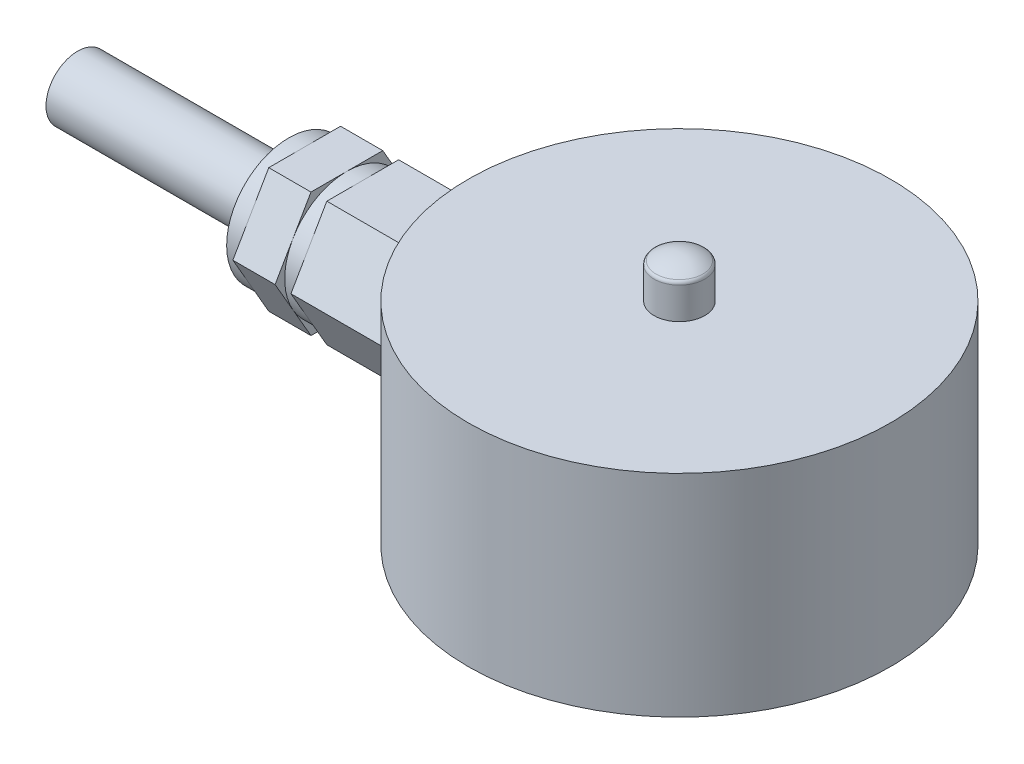
ISO-10303-21;
HEADER;
FILE_DESCRIPTION(('STEP AP214'),'2;1');
FILE_NAME('part.step','',(''),(''),'','','');
FILE_SCHEMA(('AUTOMOTIVE_DESIGN { 1 0 10303 214 1 1 1 1 }'));
ENDSEC;
DATA;
#1=APPLICATION_CONTEXT('core data for automotive mechanical design processes');
#2=APPLICATION_PROTOCOL_DEFINITION('international standard','automotive_design',2000,#1);
#3=PRODUCT_CONTEXT('',#1,'mechanical');
#4=PRODUCT('Part','Part','',(#3));
#5=PRODUCT_RELATED_PRODUCT_CATEGORY('part','',(#4));
#6=PRODUCT_DEFINITION_FORMATION('','',#4);
#7=PRODUCT_DEFINITION_CONTEXT('part definition',#1,'design');
#8=PRODUCT_DEFINITION('design','',#6,#7);
#9=PRODUCT_DEFINITION_SHAPE('','',#8);
#10=(LENGTH_UNIT() NAMED_UNIT(*) SI_UNIT(.MILLI.,.METRE.));
#11=(NAMED_UNIT(*) PLANE_ANGLE_UNIT() SI_UNIT($,.RADIAN.));
#12=(NAMED_UNIT(*) SI_UNIT($,.STERADIAN.) SOLID_ANGLE_UNIT());
#13=UNCERTAINTY_MEASURE_WITH_UNIT(LENGTH_MEASURE(1.E-05),#10,'distance_accuracy_value','');
#14=(GEOMETRIC_REPRESENTATION_CONTEXT(3) GLOBAL_UNCERTAINTY_ASSIGNED_CONTEXT((#13)) GLOBAL_UNIT_ASSIGNED_CONTEXT((#10,
#11,#12)) REPRESENTATION_CONTEXT('',''));
#15=CARTESIAN_POINT('',(0.,0.,0.));
#16=DIRECTION('',(0.,0.,1.));
#17=DIRECTION('',(1.,0.,0.));
#18=AXIS2_PLACEMENT_3D('',#15,#16,#17);
#19=CARTESIAN_POINT('',(-17.75,0.,0.));
#20=DIRECTION('',(-1.,0.,0.));
#21=DIRECTION('',(0.,0.,1.));
#22=AXIS2_PLACEMENT_3D('',#19,#20,#21);
#23=PLANE('',#22);
#24=CARTESIAN_POINT('',(-17.75,4.5,0.));
#25=DIRECTION('',(-1.,0.,0.));
#26=DIRECTION('',(0.,0.,1.));
#27=AXIS2_PLACEMENT_3D('',#24,#25,#26);
#28=CIRCLE('',#27,2.94448637286709);
#29=CARTESIAN_POINT('',(-17.75,5.97224318643355,2.55));
#30=VERTEX_POINT('',#29);
#31=CARTESIAN_POINT('',(-17.75,7.4444863728671,0.));
#32=VERTEX_POINT('',#31);
#33=EDGE_CURVE('E189',#30,#32,#28,.T.);
#34=ORIENTED_EDGE('',*,*,#33,.F.);
#35=DIRECTION('',(0.,0.866025403784439,-0.5));
#36=VECTOR('',#35,1.);
#37=CARTESIAN_POINT('',(-17.75,4.5,3.4));
#38=LINE('',#37,#36);
#39=CARTESIAN_POINT('',(-17.75,7.4444863728671,1.7));
#40=VERTEX_POINT('',#39);
#41=EDGE_CURVE('E176',#30,#40,#38,.T.);
#42=ORIENTED_EDGE('',*,*,#41,.T.);
#43=DIRECTION('',(0.,0.,-1.));
#44=VECTOR('',#43,1.);
#45=CARTESIAN_POINT('',(-17.75,7.4444863728671,1.7));
#46=LINE('',#45,#44);
#47=EDGE_CURVE('E190',#40,#32,#46,.T.);
#48=ORIENTED_EDGE('',*,*,#47,.T.);
#49=EDGE_LOOP('',(#34,#42,#48));
#50=FACE_BOUND('',#49,.T.);
#51=ADVANCED_FACE('F17',(#50),#23,.T.);
#52=CARTESIAN_POINT('',(-17.75,5.97224318643356,-2.55));
#53=VERTEX_POINT('',#52);
#54=EDGE_CURVE('E196',#32,#53,#28,.T.);
#55=ORIENTED_EDGE('',*,*,#54,.F.);
#56=CARTESIAN_POINT('',(-17.75,7.4444863728671,-1.7));
#57=VERTEX_POINT('',#56);
#58=EDGE_CURVE('E175',#32,#57,#46,.T.);
#59=ORIENTED_EDGE('',*,*,#58,.T.);
#60=DIRECTION('',(0.,-0.866025403784438,-0.5));
#61=VECTOR('',#60,1.);
#62=CARTESIAN_POINT('',(-17.75,7.4444863728671,-1.7));
#63=LINE('',#62,#61);
#64=EDGE_CURVE('E210',#57,#53,#63,.T.);
#65=ORIENTED_EDGE('',*,*,#64,.T.);
#66=EDGE_LOOP('',(#55,#59,#65));
#67=FACE_BOUND('',#66,.T.);
#68=ADVANCED_FACE('F384',(#67),#23,.T.);
#69=CARTESIAN_POINT('',(-17.75,3.02775681356646,-2.55));
#70=VERTEX_POINT('',#69);
#71=EDGE_CURVE('E359',#53,#70,#28,.T.);
#72=ORIENTED_EDGE('',*,*,#71,.F.);
#73=CARTESIAN_POINT('',(-17.75,4.5,-3.4));
#74=VERTEX_POINT('',#73);
#75=EDGE_CURVE('E209',#53,#74,#63,.T.);
#76=ORIENTED_EDGE('',*,*,#75,.T.);
#77=DIRECTION('',(0.,-0.866025403784439,0.5));
#78=VECTOR('',#77,1.);
#79=CARTESIAN_POINT('',(-17.75,4.5,-3.4));
#80=LINE('',#79,#78);
#81=EDGE_CURVE('E214',#74,#70,#80,.T.);
#82=ORIENTED_EDGE('',*,*,#81,.T.);
#83=EDGE_LOOP('',(#72,#76,#82));
#84=FACE_BOUND('',#83,.T.);
#85=ADVANCED_FACE('F390',(#84),#23,.T.);
#86=CARTESIAN_POINT('',(-17.75,1.5555136271329,0.));
#87=VERTEX_POINT('',#86);
#88=EDGE_CURVE('E200',#70,#87,#28,.T.);
#89=ORIENTED_EDGE('',*,*,#88,.F.);
#90=CARTESIAN_POINT('',(-17.75,1.5555136271329,-1.7));
#91=VERTEX_POINT('',#90);
#92=EDGE_CURVE('E213',#70,#91,#80,.T.);
#93=ORIENTED_EDGE('',*,*,#92,.T.);
#94=DIRECTION('',(0.,0.,1.));
#95=VECTOR('',#94,1.);
#96=CARTESIAN_POINT('',(-17.75,1.5555136271329,-1.7));
#97=LINE('',#96,#95);
#98=EDGE_CURVE('E218',#91,#87,#97,.T.);
#99=ORIENTED_EDGE('',*,*,#98,.T.);
#100=EDGE_LOOP('',(#89,#93,#99));
#101=FACE_BOUND('',#100,.T.);
#102=ADVANCED_FACE('F409',(#101),#23,.T.);
#103=CARTESIAN_POINT('',(-17.75,3.02775681356646,2.55));
#104=VERTEX_POINT('',#103);
#105=EDGE_CURVE('E40',#87,#104,#28,.T.);
#106=ORIENTED_EDGE('',*,*,#105,.F.);
#107=CARTESIAN_POINT('',(-17.75,1.5555136271329,1.7));
#108=VERTEX_POINT('',#107);
#109=EDGE_CURVE('E217',#87,#108,#97,.T.);
#110=ORIENTED_EDGE('',*,*,#109,.T.);
#111=DIRECTION('',(0.,0.866025403784439,0.5));
#112=VECTOR('',#111,1.);
#113=CARTESIAN_POINT('',(-17.75,1.5555136271329,1.7));
#114=LINE('',#113,#112);
#115=EDGE_CURVE('E221',#108,#104,#114,.T.);
#116=ORIENTED_EDGE('',*,*,#115,.T.);
#117=EDGE_LOOP('',(#106,#110,#116));
#118=FACE_BOUND('',#117,.T.);
#119=ADVANCED_FACE('F396',(#118),#23,.T.);
#120=CARTESIAN_POINT('',(-15.,0.,0.));
#121=DIRECTION('',(1.,0.,0.));
#122=DIRECTION('',(0.,0.,-1.));
#123=AXIS2_PLACEMENT_3D('',#120,#121,#122);
#124=PLANE('',#123);
#125=CARTESIAN_POINT('',(-15.,4.5,0.));
#126=DIRECTION('',(-1.,0.,0.));
#127=DIRECTION('',(0.,0.,1.));
#128=AXIS2_PLACEMENT_3D('',#125,#126,#127);
#129=CIRCLE('',#128,2.94448637286709);
#130=CARTESIAN_POINT('',(-15.,5.97224318643355,2.55));
#131=VERTEX_POINT('',#130);
#132=CARTESIAN_POINT('',(-15.,7.4444863728671,0.));
#133=VERTEX_POINT('',#132);
#134=EDGE_CURVE('E204',#131,#133,#129,.T.);
#135=ORIENTED_EDGE('',*,*,#134,.F.);
#136=DIRECTION('',(0.,-0.866025403784439,0.5));
#137=VECTOR('',#136,1.);
#138=CARTESIAN_POINT('',(-15.,7.4444863728671,1.7));
#139=LINE('',#138,#137);
#140=CARTESIAN_POINT('',(-15.,7.4444863728671,1.7));
#141=VERTEX_POINT('',#140);
#142=EDGE_CURVE('E296',#141,#131,#139,.T.);
#143=ORIENTED_EDGE('',*,*,#142,.F.);
#144=DIRECTION('',(0.,0.,1.));
#145=VECTOR('',#144,1.);
#146=CARTESIAN_POINT('',(-15.,7.4444863728671,-1.7));
#147=LINE('',#146,#145);
#148=EDGE_CURVE('E291',#133,#141,#147,.T.);
#149=ORIENTED_EDGE('',*,*,#148,.F.);
#150=EDGE_LOOP('',(#135,#143,#149));
#151=FACE_BOUND('',#150,.T.);
#152=ADVANCED_FACE('F408',(#151),#124,.F.);
#153=CARTESIAN_POINT('',(-15.,5.97224318643355,-2.55));
#154=VERTEX_POINT('',#153);
#155=EDGE_CURVE('E199',#133,#154,#129,.T.);
#156=ORIENTED_EDGE('',*,*,#155,.F.);
#157=CARTESIAN_POINT('',(-15.,7.4444863728671,-1.7));
#158=VERTEX_POINT('',#157);
#159=EDGE_CURVE('E292',#158,#133,#147,.T.);
#160=ORIENTED_EDGE('',*,*,#159,.F.);
#161=DIRECTION('',(0.,0.866025403784439,0.5));
#162=VECTOR('',#161,1.);
#163=CARTESIAN_POINT('',(-15.,4.5,-3.4));
#164=LINE('',#163,#162);
#165=EDGE_CURVE('E287',#154,#158,#164,.T.);
#166=ORIENTED_EDGE('',*,*,#165,.F.);
#167=EDGE_LOOP('',(#156,#160,#166));
#168=FACE_BOUND('',#167,.T.);
#169=ADVANCED_FACE('F415',(#168),#124,.F.);
#170=CARTESIAN_POINT('',(-15.,3.02775681356646,-2.55));
#171=VERTEX_POINT('',#170);
#172=EDGE_CURVE('E202',#154,#171,#129,.T.);
#173=ORIENTED_EDGE('',*,*,#172,.F.);
#174=CARTESIAN_POINT('',(-15.,4.5,-3.4));
#175=VERTEX_POINT('',#174);
#176=EDGE_CURVE('E288',#175,#154,#164,.T.);
#177=ORIENTED_EDGE('',*,*,#176,.F.);
#178=DIRECTION('',(0.,0.866025403784439,-0.5));
#179=VECTOR('',#178,1.);
#180=CARTESIAN_POINT('',(-15.,1.5555136271329,-1.7));
#181=LINE('',#180,#179);
#182=EDGE_CURVE('E283',#171,#175,#181,.T.);
#183=ORIENTED_EDGE('',*,*,#182,.F.);
#184=EDGE_LOOP('',(#173,#177,#183));
#185=FACE_BOUND('',#184,.T.);
#186=ADVANCED_FACE('F762',(#185),#124,.F.);
#187=CARTESIAN_POINT('',(-15.,1.5555136271329,0.));
#188=VERTEX_POINT('',#187);
#189=EDGE_CURVE('E922',#171,#188,#129,.T.);
#190=ORIENTED_EDGE('',*,*,#189,.F.);
#191=CARTESIAN_POINT('',(-15.,1.5555136271329,-1.7));
#192=VERTEX_POINT('',#191);
#193=EDGE_CURVE('E284',#192,#171,#181,.T.);
#194=ORIENTED_EDGE('',*,*,#193,.F.);
#195=DIRECTION('',(0.,0.,-1.));
#196=VECTOR('',#195,1.);
#197=CARTESIAN_POINT('',(-15.,1.5555136271329,1.7));
#198=LINE('',#197,#196);
#199=EDGE_CURVE('E262',#188,#192,#198,.T.);
#200=ORIENTED_EDGE('',*,*,#199,.F.);
#201=EDGE_LOOP('',(#190,#194,#200));
#202=FACE_BOUND('',#201,.T.);
#203=ADVANCED_FACE('F755',(#202),#124,.F.);
#204=CARTESIAN_POINT('',(-15.,3.02775681356646,2.55));
#205=VERTEX_POINT('',#204);
#206=EDGE_CURVE('E917',#188,#205,#129,.T.);
#207=ORIENTED_EDGE('',*,*,#206,.F.);
#208=CARTESIAN_POINT('',(-15.,1.5555136271329,1.7));
#209=VERTEX_POINT('',#208);
#210=EDGE_CURVE('E280',#209,#188,#198,.T.);
#211=ORIENTED_EDGE('',*,*,#210,.F.);
#212=DIRECTION('',(0.,-0.866025403784439,-0.5));
#213=VECTOR('',#212,1.);
#214=CARTESIAN_POINT('',(-15.,4.5,3.4));
#215=LINE('',#214,#213);
#216=EDGE_CURVE('E298',#205,#209,#215,.T.);
#217=ORIENTED_EDGE('',*,*,#216,.F.);
#218=EDGE_LOOP('',(#207,#211,#217));
#219=FACE_BOUND('',#218,.T.);
#220=ADVANCED_FACE('F653',(#219),#124,.F.);
#221=CARTESIAN_POINT('',(0.,10.,0.));
#222=DIRECTION('',(0.,-1.,0.));
#223=DIRECTION('',(0.,0.,-1.));
#224=AXIS2_PLACEMENT_3D('',#221,#222,#223);
#225=CYLINDRICAL_SURFACE('',#224,10.);
#226=CARTESIAN_POINT('',(0.,0.,0.));
#227=DIRECTION('',(0.,1.,0.));
#228=DIRECTION('',(0.,0.,1.));
#229=AXIS2_PLACEMENT_3D('',#226,#227,#228);
#230=CIRCLE('',#229,10.);
#231=CARTESIAN_POINT('',(0.,0.,10.));
#232=VERTEX_POINT('',#231);
#233=EDGE_CURVE('E341',#232,#232,#230,.T.);
#234=ORIENTED_EDGE('',*,*,#233,.T.);
#235=EDGE_LOOP('',(#234));
#236=FACE_BOUND('',#235,.T.);
#237=CARTESIAN_POINT('',(0.,10.,0.));
#238=DIRECTION('',(0.,1.,0.));
#239=DIRECTION('',(0.,0.,1.));
#240=AXIS2_PLACEMENT_3D('',#237,#238,#239);
#241=CIRCLE('',#240,10.);
#242=CARTESIAN_POINT('',(0.,10.,10.));
#243=VERTEX_POINT('',#242);
#244=EDGE_CURVE('E342',#243,#243,#241,.T.);
#245=ORIENTED_EDGE('',*,*,#244,.F.);
#246=EDGE_LOOP('',(#245));
#247=FACE_BOUND('',#246,.T.);
#248=CARTESIAN_POINT('',(0.,-1.38897274573418,0.));
#249=DIRECTION('',(0.,0.5,-0.866025403784439));
#250=DIRECTION('',(0.,-0.866025403784439,-0.5));
#251=AXIS2_PLACEMENT_3D('',#248,#249,#250);
#252=ELLIPSE('',#251,20.,10.);
#253=CARTESIAN_POINT('',(-9.40425435640699,4.5,3.4));
#254=VERTEX_POINT('',#253);
#255=CARTESIAN_POINT('',(-9.8544406233941,1.5555136271329,1.7));
#256=VERTEX_POINT('',#255);
#257=EDGE_CURVE('E279',#254,#256,#252,.F.);
#258=ORIENTED_EDGE('',*,*,#257,.T.);
#259=CARTESIAN_POINT('',(0.,1.5555136271329,0.));
#260=DIRECTION('',(0.,1.,0.));
#261=DIRECTION('',(0.,0.,1.));
#262=AXIS2_PLACEMENT_3D('',#259,#260,#261);
#263=CIRCLE('',#262,10.);
#264=CARTESIAN_POINT('',(-9.8544406233941,1.5555136271329,-1.7));
#265=VERTEX_POINT('',#264);
#266=EDGE_CURVE('E277',#256,#265,#263,.F.);
#267=ORIENTED_EDGE('',*,*,#266,.T.);
#268=CARTESIAN_POINT('',(0.,-1.38897274573419,0.));
#269=DIRECTION('',(0.,0.5,0.866025403784439));
#270=DIRECTION('',(0.,-0.866025403784439,0.5));
#271=AXIS2_PLACEMENT_3D('',#268,#269,#270);
#272=ELLIPSE('',#271,20.,10.);
#273=CARTESIAN_POINT('',(-9.40425435640699,4.5,-3.4));
#274=VERTEX_POINT('',#273);
#275=EDGE_CURVE('E275',#265,#274,#272,.F.);
#276=ORIENTED_EDGE('',*,*,#275,.T.);
#277=CARTESIAN_POINT('',(0.,10.3889727457342,0.));
#278=DIRECTION('',(0.,-0.5,0.866025403784439));
#279=DIRECTION('',(0.,-0.866025403784439,-0.5));
#280=AXIS2_PLACEMENT_3D('',#277,#278,#279);
#281=ELLIPSE('',#280,20.,10.);
#282=CARTESIAN_POINT('',(-9.8544406233941,7.4444863728671,-1.7));
#283=VERTEX_POINT('',#282);
#284=EDGE_CURVE('E273',#274,#283,#281,.F.);
#285=ORIENTED_EDGE('',*,*,#284,.T.);
#286=CARTESIAN_POINT('',(0.,7.4444863728671,0.));
#287=DIRECTION('',(0.,-1.,0.));
#288=DIRECTION('',(0.,0.,-1.));
#289=AXIS2_PLACEMENT_3D('',#286,#287,#288);
#290=CIRCLE('',#289,10.);
#291=CARTESIAN_POINT('',(-9.8544406233941,7.4444863728671,1.7));
#292=VERTEX_POINT('',#291);
#293=EDGE_CURVE('E270',#283,#292,#290,.F.);
#294=ORIENTED_EDGE('',*,*,#293,.T.);
#295=CARTESIAN_POINT('',(0.,10.3889727457342,0.));
#296=DIRECTION('',(0.,-0.5,-0.866025403784439));
#297=DIRECTION('',(0.,-0.866025403784439,0.5));
#298=AXIS2_PLACEMENT_3D('',#295,#296,#297);
#299=ELLIPSE('',#298,20.,10.);
#300=EDGE_CURVE('E268',#292,#254,#299,.F.);
#301=ORIENTED_EDGE('',*,*,#300,.T.);
#302=EDGE_LOOP('',(#258,#267,#276,#285,#294,#301));
#303=FACE_BOUND('',#302,.T.);
#304=ADVANCED_FACE('F656',(#236,#247,#303),#225,.T.);
#305=CARTESIAN_POINT('',(0.,10.,0.));
#306=DIRECTION('',(0.,1.,0.));
#307=DIRECTION('',(0.,0.,1.));
#308=AXIS2_PLACEMENT_3D('',#305,#306,#307);
#309=PLANE('',#308);
#310=CARTESIAN_POINT('',(0.,10.,0.));
#311=DIRECTION('',(0.,1.,0.));
#312=DIRECTION('',(0.,0.,1.));
#313=AXIS2_PLACEMENT_3D('',#310,#311,#312);
#314=CIRCLE('',#313,1.2);
#315=CARTESIAN_POINT('',(0.,10.,1.2));
#316=VERTEX_POINT('',#315);
#317=EDGE_CURVE('E338',#316,#316,#314,.T.);
#318=ORIENTED_EDGE('',*,*,#317,.F.);
#319=EDGE_LOOP('',(#318));
#320=FACE_BOUND('',#319,.T.);
#321=ORIENTED_EDGE('',*,*,#244,.T.);
#322=EDGE_LOOP('',(#321));
#323=FACE_BOUND('',#322,.T.);
#324=ADVANCED_FACE('F661',(#320,#323),#309,.T.);
#325=CARTESIAN_POINT('',(0.,0.,0.));
#326=DIRECTION('',(0.,1.,0.));
#327=DIRECTION('',(0.,0.,1.));
#328=AXIS2_PLACEMENT_3D('',#325,#326,#327);
#329=PLANE('',#328);
#330=CARTESIAN_POINT('',(0.,0.,0.));
#331=DIRECTION('',(0.,1.,0.));
#332=DIRECTION('',(0.,0.,1.));
#333=AXIS2_PLACEMENT_3D('',#330,#331,#332);
#334=CIRCLE('',#333,5.7);
#335=CARTESIAN_POINT('',(0.,0.,5.7));
#336=VERTEX_POINT('',#335);
#337=EDGE_CURVE('E11',#336,#336,#334,.T.);
#338=ORIENTED_EDGE('',*,*,#337,.T.);
#339=EDGE_LOOP('',(#338));
#340=FACE_BOUND('',#339,.T.);
#341=CARTESIAN_POINT('',(-3.74999999999994,0.,6.49519052838333));
#342=DIRECTION('',(0.,-1.,0.));
#343=DIRECTION('',(0.,0.,-1.));
#344=AXIS2_PLACEMENT_3D('',#341,#342,#343);
#345=CIRCLE('',#344,1.25);
#346=CARTESIAN_POINT('',(-3.74999999999994,0.,5.24519052838333));
#347=VERTEX_POINT('',#346);
#348=EDGE_CURVE('E320',#347,#347,#345,.T.);
#349=ORIENTED_EDGE('',*,*,#348,.F.);
#350=EDGE_LOOP('',(#349));
#351=FACE_BOUND('',#350,.T.);
#352=CARTESIAN_POINT('',(-3.75,0.,-6.49519052838327));
#353=DIRECTION('',(0.,-1.,0.));
#354=DIRECTION('',(0.,0.,-1.));
#355=AXIS2_PLACEMENT_3D('',#352,#353,#354);
#356=CIRCLE('',#355,1.25);
#357=CARTESIAN_POINT('',(-3.75,0.,-7.74519052838327));
#358=VERTEX_POINT('',#357);
#359=EDGE_CURVE('E326',#358,#358,#356,.T.);
#360=ORIENTED_EDGE('',*,*,#359,.F.);
#361=EDGE_LOOP('',(#360));
#362=FACE_BOUND('',#361,.T.);
#363=CARTESIAN_POINT('',(7.5,0.,0.));
#364=DIRECTION('',(0.,-1.,0.));
#365=DIRECTION('',(0.,0.,-1.));
#366=AXIS2_PLACEMENT_3D('',#363,#364,#365);
#367=CIRCLE('',#366,1.25);
#368=CARTESIAN_POINT('',(7.5,0.,-1.25));
#369=VERTEX_POINT('',#368);
#370=EDGE_CURVE('E332',#369,#369,#367,.T.);
#371=ORIENTED_EDGE('',*,*,#370,.F.);
#372=EDGE_LOOP('',(#371));
#373=FACE_BOUND('',#372,.T.);
#374=ORIENTED_EDGE('',*,*,#233,.F.);
#375=EDGE_LOOP('',(#374));
#376=FACE_BOUND('',#375,.T.);
#377=ADVANCED_FACE('F524',(#340,#351,#362,#373,#376),#329,.F.);
#378=CARTESIAN_POINT('',(0.,11.6,0.));
#379=DIRECTION('',(0.,-1.,0.));
#380=DIRECTION('',(0.,0.,-1.));
#381=AXIS2_PLACEMENT_3D('',#378,#379,#380);
#382=CYLINDRICAL_SURFACE('',#381,1.2);
#383=CARTESIAN_POINT('',(0.,11.4966629547096,0.));
#384=DIRECTION('',(0.,-1.,0.));
#385=DIRECTION('',(0.,0.,-1.));
#386=AXIS2_PLACEMENT_3D('',#383,#384,#385);
#387=CIRCLE('',#386,1.2);
#388=CARTESIAN_POINT('',(0.,11.4966629547096,-1.2));
#389=VERTEX_POINT('',#388);
#390=EDGE_CURVE('E350',#389,#389,#387,.T.);
#391=ORIENTED_EDGE('',*,*,#390,.T.);
#392=EDGE_LOOP('',(#391));
#393=FACE_BOUND('',#392,.T.);
#394=ORIENTED_EDGE('',*,*,#317,.T.);
#395=EDGE_LOOP('',(#394));
#396=FACE_BOUND('',#395,.T.);
#397=ADVANCED_FACE('F735',(#393,#396),#382,.T.);
#398=CARTESIAN_POINT('',(0.,10.,0.));
#399=DIRECTION('',(0.,0.,1.));
#400=DIRECTION('',(1.,0.,0.));
#401=AXIS2_PLACEMENT_3D('',#398,#399,#400);
#402=SPHERICAL_SURFACE('',#401,2.);
#403=CARTESIAN_POINT('',(0.,10.,0.));
#404=DIRECTION('',(0.,-1.,0.));
#405=DIRECTION('',(0.,0.,-1.));
#406=AXIS2_PLACEMENT_3D('',#403,#404,#405);
#407=SPHERICAL_SURFACE('',#406,2.);
#408=CARTESIAN_POINT('',(0.,11.6629588385662,0.));
#409=DIRECTION('',(0.,-1.,0.));
#410=DIRECTION('',(0.,0.,-1.));
#411=AXIS2_PLACEMENT_3D('',#408,#409,#410);
#412=CIRCLE('',#411,1.11111111111111);
#413=CARTESIAN_POINT('',(0.,11.6629588385662,-1.11111111111111));
#414=VERTEX_POINT('',#413);
#415=EDGE_CURVE('E345',#414,#414,#412,.F.);
#416=ORIENTED_EDGE('',*,*,#415,.T.);
#417=EDGE_LOOP('',(#416));
#418=FACE_BOUND('',#417,.T.);
#419=ADVANCED_FACE('F728',(#418),#407,.T.);
#420=CARTESIAN_POINT('',(0.,11.4966629547096,0.));
#421=DIRECTION('',(0.,-1.,0.));
#422=DIRECTION('',(0.,0.,-1.));
#423=AXIS2_PLACEMENT_3D('',#420,#421,#422);
#424=TOROIDAL_SURFACE('',#423,1.,0.2);
#425=ORIENTED_EDGE('',*,*,#390,.F.);
#426=EDGE_LOOP('',(#425));
#427=FACE_BOUND('',#426,.T.);
#428=ORIENTED_EDGE('',*,*,#415,.F.);
#429=EDGE_LOOP('',(#428));
#430=FACE_BOUND('',#429,.T.);
#431=ADVANCED_FACE('F720',(#427,#430),#424,.T.);
#432=CARTESIAN_POINT('',(7.5,7.5,0.));
#433=DIRECTION('',(0.,-1.,0.));
#434=DIRECTION('',(0.,0.,-1.));
#435=AXIS2_PLACEMENT_3D('',#432,#433,#434);
#436=CONICAL_SURFACE('',#435,1.25,1.02974425867665);
#437=CARTESIAN_POINT('',(7.5,8.25107577378445,0.));
#438=VERTEX_POINT('',#437);
#439=VERTEX_LOOP('',#438);
#440=FACE_BOUND('',#439,.T.);
#441=CARTESIAN_POINT('',(7.5,7.5,0.));
#442=DIRECTION('',(0.,-1.,0.));
#443=DIRECTION('',(0.,0.,-1.));
#444=AXIS2_PLACEMENT_3D('',#441,#442,#443);
#445=CIRCLE('',#444,1.25);
#446=CARTESIAN_POINT('',(7.5,7.5,-1.25));
#447=VERTEX_POINT('',#446);
#448=EDGE_CURVE('E335',#447,#447,#445,.T.);
#449=ORIENTED_EDGE('',*,*,#448,.T.);
#450=EDGE_LOOP('',(#449));
#451=FACE_BOUND('',#450,.T.);
#452=ADVANCED_FACE('F710',(#440,#451),#436,.F.);
#453=CARTESIAN_POINT('',(7.5,0.,0.));
#454=DIRECTION('',(0.,-1.,0.));
#455=DIRECTION('',(0.,0.,-1.));
#456=AXIS2_PLACEMENT_3D('',#453,#454,#455);
#457=CYLINDRICAL_SURFACE('',#456,1.25);
#458=ORIENTED_EDGE('',*,*,#448,.F.);
#459=EDGE_LOOP('',(#458));
#460=FACE_BOUND('',#459,.T.);
#461=ORIENTED_EDGE('',*,*,#370,.T.);
#462=EDGE_LOOP('',(#461));
#463=FACE_BOUND('',#462,.T.);
#464=ADVANCED_FACE('F702',(#460,#463),#457,.F.);
#465=CARTESIAN_POINT('',(-3.75,7.5,-6.49519052838327));
#466=DIRECTION('',(0.,-1.,0.));
#467=DIRECTION('',(0.,0.,-1.));
#468=AXIS2_PLACEMENT_3D('',#465,#466,#467);
#469=CONICAL_SURFACE('',#468,1.25,1.02974425867665);
#470=CARTESIAN_POINT('',(-3.75,8.25107577378445,-6.49519052838327));
#471=VERTEX_POINT('',#470);
#472=VERTEX_LOOP('',#471);
#473=FACE_BOUND('',#472,.T.);
#474=CARTESIAN_POINT('',(-3.75,7.5,-6.49519052838327));
#475=DIRECTION('',(0.,-1.,0.));
#476=DIRECTION('',(0.,0.,-1.));
#477=AXIS2_PLACEMENT_3D('',#474,#475,#476);
#478=CIRCLE('',#477,1.25);
#479=CARTESIAN_POINT('',(-3.75,7.5,-7.74519052838327));
#480=VERTEX_POINT('',#479);
#481=EDGE_CURVE('E329',#480,#480,#478,.T.);
#482=ORIENTED_EDGE('',*,*,#481,.T.);
#483=EDGE_LOOP('',(#482));
#484=FACE_BOUND('',#483,.T.);
#485=ADVANCED_FACE('F692',(#473,#484),#469,.F.);
#486=CARTESIAN_POINT('',(-3.75,0.,-6.49519052838327));
#487=DIRECTION('',(0.,-1.,0.));
#488=DIRECTION('',(0.,0.,-1.));
#489=AXIS2_PLACEMENT_3D('',#486,#487,#488);
#490=CYLINDRICAL_SURFACE('',#489,1.25);
#491=ORIENTED_EDGE('',*,*,#481,.F.);
#492=EDGE_LOOP('',(#491));
#493=FACE_BOUND('',#492,.T.);
#494=ORIENTED_EDGE('',*,*,#359,.T.);
#495=EDGE_LOOP('',(#494));
#496=FACE_BOUND('',#495,.T.);
#497=ADVANCED_FACE('F684',(#493,#496),#490,.F.);
#498=CARTESIAN_POINT('',(-3.74999999999994,7.5,6.49519052838333));
#499=DIRECTION('',(0.,-1.,0.));
#500=DIRECTION('',(0.,0.,-1.));
#501=AXIS2_PLACEMENT_3D('',#498,#499,#500);
#502=CONICAL_SURFACE('',#501,1.25,1.02974425867665);
#503=CARTESIAN_POINT('',(-3.74999999999994,8.25107577378445,6.49519052838333));
#504=VERTEX_POINT('',#503);
#505=VERTEX_LOOP('',#504);
#506=FACE_BOUND('',#505,.T.);
#507=CARTESIAN_POINT('',(-3.74999999999994,7.5,6.49519052838333));
#508=DIRECTION('',(0.,-1.,0.));
#509=DIRECTION('',(0.,0.,-1.));
#510=AXIS2_PLACEMENT_3D('',#507,#508,#509);
#511=CIRCLE('',#510,1.25);
#512=CARTESIAN_POINT('',(-3.74999999999994,7.5,5.24519052838333));
#513=VERTEX_POINT('',#512);
#514=EDGE_CURVE('E323',#513,#513,#511,.T.);
#515=ORIENTED_EDGE('',*,*,#514,.T.);
#516=EDGE_LOOP('',(#515));
#517=FACE_BOUND('',#516,.T.);
#518=ADVANCED_FACE('F671',(#506,#517),#502,.F.);
#519=CARTESIAN_POINT('',(-3.74999999999994,0.,6.49519052838333));
#520=DIRECTION('',(0.,-1.,0.));
#521=DIRECTION('',(0.,0.,-1.));
#522=AXIS2_PLACEMENT_3D('',#519,#520,#521);
#523=CYLINDRICAL_SURFACE('',#522,1.25);
#524=ORIENTED_EDGE('',*,*,#514,.F.);
#525=EDGE_LOOP('',(#524));
#526=FACE_BOUND('',#525,.T.);
#527=ORIENTED_EDGE('',*,*,#348,.T.);
#528=EDGE_LOOP('',(#527));
#529=FACE_BOUND('',#528,.T.);
#530=ADVANCED_FACE('F651',(#526,#529),#523,.F.);
#531=EDGE_CURVE('E267',#205,#131,#129,.T.);
#532=ORIENTED_EDGE('',*,*,#531,.F.);
#533=CARTESIAN_POINT('',(-15.,4.5,3.4));
#534=VERTEX_POINT('',#533);
#535=EDGE_CURVE('E299',#534,#205,#215,.T.);
#536=ORIENTED_EDGE('',*,*,#535,.F.);
#537=EDGE_CURVE('E295',#131,#534,#139,.T.);
#538=ORIENTED_EDGE('',*,*,#537,.F.);
#539=EDGE_LOOP('',(#532,#536,#538));
#540=FACE_BOUND('',#539,.T.);
#541=ADVANCED_FACE('F418',(#540),#124,.F.);
#542=CARTESIAN_POINT('',(10.001,4.5,3.4));
#543=DIRECTION('',(0.,0.5,-0.866025403784439));
#544=DIRECTION('',(0.,0.866025403784439,0.5));
#545=AXIS2_PLACEMENT_3D('',#542,#543,#544);
#546=PLANE('',#545);
#547=ORIENTED_EDGE('',*,*,#257,.F.);
#548=DIRECTION('',(-1.,0.,0.));
#549=VECTOR('',#548,1.);
#550=CARTESIAN_POINT('',(10.001,4.5,3.4));
#551=LINE('',#550,#549);
#552=EDGE_CURVE('E305',#254,#534,#551,.T.);
#553=ORIENTED_EDGE('',*,*,#552,.T.);
#554=ORIENTED_EDGE('',*,*,#535,.T.);
#555=ORIENTED_EDGE('',*,*,#216,.T.);
#556=DIRECTION('',(-1.,0.,0.));
#557=VECTOR('',#556,1.);
#558=CARTESIAN_POINT('',(10.001,1.5555136271329,1.7));
#559=LINE('',#558,#557);
#560=EDGE_CURVE('E302',#256,#209,#559,.T.);
#561=ORIENTED_EDGE('',*,*,#560,.F.);
#562=EDGE_LOOP('',(#547,#553,#554,#555,#561));
#563=FACE_BOUND('',#562,.T.);
#564=ADVANCED_FACE('F527',(#563),#546,.F.);
#565=CARTESIAN_POINT('',(10.001,7.4444863728671,1.7));
#566=DIRECTION('',(0.,-0.5,-0.866025403784439));
#567=DIRECTION('',(0.,0.866025403784439,-0.5));
#568=AXIS2_PLACEMENT_3D('',#565,#566,#567);
#569=PLANE('',#568);
#570=ORIENTED_EDGE('',*,*,#300,.F.);
#571=DIRECTION('',(-1.,0.,0.));
#572=VECTOR('',#571,1.);
#573=CARTESIAN_POINT('',(10.001,7.4444863728671,1.7));
#574=LINE('',#573,#572);
#575=EDGE_CURVE('E308',#292,#141,#574,.T.);
#576=ORIENTED_EDGE('',*,*,#575,.T.);
#577=ORIENTED_EDGE('',*,*,#142,.T.);
#578=ORIENTED_EDGE('',*,*,#537,.T.);
#579=ORIENTED_EDGE('',*,*,#552,.F.);
#580=EDGE_LOOP('',(#570,#576,#577,#578,#579));
#581=FACE_BOUND('',#580,.T.);
#582=ADVANCED_FACE('F532',(#581),#569,.F.);
#583=CARTESIAN_POINT('',(10.001,7.4444863728671,-1.7));
#584=DIRECTION('',(0.,-1.,0.));
#585=DIRECTION('',(0.,0.,-1.));
#586=AXIS2_PLACEMENT_3D('',#583,#584,#585);
#587=PLANE('',#586);
#588=ORIENTED_EDGE('',*,*,#293,.F.);
#589=DIRECTION('',(-1.,0.,0.));
#590=VECTOR('',#589,1.);
#591=CARTESIAN_POINT('',(10.001,7.4444863728671,-1.7));
#592=LINE('',#591,#590);
#593=EDGE_CURVE('E311',#283,#158,#592,.T.);
#594=ORIENTED_EDGE('',*,*,#593,.T.);
#595=ORIENTED_EDGE('',*,*,#159,.T.);
#596=ORIENTED_EDGE('',*,*,#148,.T.);
#597=ORIENTED_EDGE('',*,*,#575,.F.);
#598=EDGE_LOOP('',(#588,#594,#595,#596,#597));
#599=FACE_BOUND('',#598,.T.);
#600=ADVANCED_FACE('F631',(#599),#587,.F.);
#601=CARTESIAN_POINT('',(10.001,4.5,-3.4));
#602=DIRECTION('',(0.,-0.5,0.866025403784439));
#603=DIRECTION('',(0.,-0.866025403784439,-0.5));
#604=AXIS2_PLACEMENT_3D('',#601,#602,#603);
#605=PLANE('',#604);
#606=ORIENTED_EDGE('',*,*,#284,.F.);
#607=DIRECTION('',(-1.,0.,0.));
#608=VECTOR('',#607,1.);
#609=CARTESIAN_POINT('',(10.001,4.5,-3.4));
#610=LINE('',#609,#608);
#611=EDGE_CURVE('E314',#274,#175,#610,.T.);
#612=ORIENTED_EDGE('',*,*,#611,.T.);
#613=ORIENTED_EDGE('',*,*,#176,.T.);
#614=ORIENTED_EDGE('',*,*,#165,.T.);
#615=ORIENTED_EDGE('',*,*,#593,.F.);
#616=EDGE_LOOP('',(#606,#612,#613,#614,#615));
#617=FACE_BOUND('',#616,.T.);
#618=ADVANCED_FACE('F623',(#617),#605,.F.);
#619=CARTESIAN_POINT('',(10.001,1.5555136271329,-1.7));
#620=DIRECTION('',(0.,0.5,0.866025403784439));
#621=DIRECTION('',(0.,-0.866025403784439,0.5));
#622=AXIS2_PLACEMENT_3D('',#619,#620,#621);
#623=PLANE('',#622);
#624=ORIENTED_EDGE('',*,*,#275,.F.);
#625=DIRECTION('',(-1.,0.,0.));
#626=VECTOR('',#625,1.);
#627=CARTESIAN_POINT('',(10.001,1.5555136271329,-1.7));
#628=LINE('',#627,#626);
#629=EDGE_CURVE('E271',#265,#192,#628,.T.);
#630=ORIENTED_EDGE('',*,*,#629,.T.);
#631=ORIENTED_EDGE('',*,*,#193,.T.);
#632=ORIENTED_EDGE('',*,*,#182,.T.);
#633=ORIENTED_EDGE('',*,*,#611,.F.);
#634=EDGE_LOOP('',(#624,#630,#631,#632,#633));
#635=FACE_BOUND('',#634,.T.);
#636=ADVANCED_FACE('F615',(#635),#623,.F.);
#637=CARTESIAN_POINT('',(10.001,1.5555136271329,1.7));
#638=DIRECTION('',(0.,1.,0.));
#639=DIRECTION('',(0.,0.,1.));
#640=AXIS2_PLACEMENT_3D('',#637,#638,#639);
#641=PLANE('',#640);
#642=ORIENTED_EDGE('',*,*,#266,.F.);
#643=ORIENTED_EDGE('',*,*,#560,.T.);
#644=ORIENTED_EDGE('',*,*,#210,.T.);
#645=ORIENTED_EDGE('',*,*,#199,.T.);
#646=ORIENTED_EDGE('',*,*,#629,.F.);
#647=EDGE_LOOP('',(#642,#643,#644,#645,#646));
#648=FACE_BOUND('',#647,.T.);
#649=ADVANCED_FACE('F608',(#648),#641,.F.);
#650=CARTESIAN_POINT('',(-15.75,4.5,0.));
#651=DIRECTION('',(1.,0.,0.));
#652=DIRECTION('',(0.,0.,-1.));
#653=AXIS2_PLACEMENT_3D('',#650,#651,#652);
#654=CYLINDRICAL_SURFACE('',#653,2.94448637286709);
#655=CARTESIAN_POINT('',(-15.75,4.5,0.));
#656=DIRECTION('',(-1.,0.,0.));
#657=DIRECTION('',(0.,0.,1.));
#658=AXIS2_PLACEMENT_3D('',#655,#656,#657);
#659=CIRCLE('',#658,2.94448637286709);
#660=CARTESIAN_POINT('',(-15.75,5.97224318643355,2.55));
#661=VERTEX_POINT('',#660);
#662=CARTESIAN_POINT('',(-15.75,7.4444863728671,0.));
#663=VERTEX_POINT('',#662);
#664=EDGE_CURVE('E260',#661,#663,#659,.T.);
#665=ORIENTED_EDGE('',*,*,#664,.F.);
#666=CARTESIAN_POINT('',(-15.75,3.02775681356645,2.55));
#667=VERTEX_POINT('',#666);
#668=EDGE_CURVE('E264',#667,#661,#659,.T.);
#669=ORIENTED_EDGE('',*,*,#668,.F.);
#670=CARTESIAN_POINT('',(-15.75,1.5555136271329,0.));
#671=VERTEX_POINT('',#670);
#672=EDGE_CURVE('E469',#671,#667,#659,.T.);
#673=ORIENTED_EDGE('',*,*,#672,.F.);
#674=CARTESIAN_POINT('',(-15.75,3.02775681356646,-2.55));
#675=VERTEX_POINT('',#674);
#676=EDGE_CURVE('E452',#675,#671,#659,.T.);
#677=ORIENTED_EDGE('',*,*,#676,.F.);
#678=CARTESIAN_POINT('',(-15.75,5.97224318643355,-2.55));
#679=VERTEX_POINT('',#678);
#680=EDGE_CURVE('E448',#679,#675,#659,.T.);
#681=ORIENTED_EDGE('',*,*,#680,.F.);
#682=EDGE_CURVE('E263',#663,#679,#659,.T.);
#683=ORIENTED_EDGE('',*,*,#682,.F.);
#684=EDGE_LOOP('',(#665,#669,#673,#677,#681,#683));
#685=FACE_BOUND('',#684,.T.);
#686=ORIENTED_EDGE('',*,*,#134,.T.);
#687=ORIENTED_EDGE('',*,*,#155,.T.);
#688=ORIENTED_EDGE('',*,*,#172,.T.);
#689=ORIENTED_EDGE('',*,*,#189,.T.);
#690=ORIENTED_EDGE('',*,*,#206,.T.);
#691=ORIENTED_EDGE('',*,*,#531,.T.);
#692=EDGE_LOOP('',(#686,#687,#688,#689,#690,#691));
#693=FACE_BOUND('',#692,.T.);
#694=ADVANCED_FACE('F602',(#685,#693),#654,.T.);
#695=CARTESIAN_POINT('',(-15.75,0.,0.));
#696=DIRECTION('',(-1.,0.,0.));
#697=DIRECTION('',(0.,0.,1.));
#698=AXIS2_PLACEMENT_3D('',#695,#696,#697);
#699=PLANE('',#698);
#700=DIRECTION('',(0.,0.866025403784439,-0.5));
#701=VECTOR('',#700,1.);
#702=CARTESIAN_POINT('',(-15.75,4.5,3.4));
#703=LINE('',#702,#701);
#704=CARTESIAN_POINT('',(-15.75,7.4444863728671,1.7));
#705=VERTEX_POINT('',#704);
#706=EDGE_CURVE('E227',#661,#705,#703,.T.);
#707=ORIENTED_EDGE('',*,*,#706,.F.);
#708=ORIENTED_EDGE('',*,*,#664,.T.);
#709=DIRECTION('',(0.,0.,-1.));
#710=VECTOR('',#709,1.);
#711=CARTESIAN_POINT('',(-15.75,7.4444863728671,1.7));
#712=LINE('',#711,#710);
#713=EDGE_CURVE('E228',#705,#663,#712,.T.);
#714=ORIENTED_EDGE('',*,*,#713,.F.);
#715=EDGE_LOOP('',(#707,#708,#714));
#716=FACE_BOUND('',#715,.T.);
#717=ADVANCED_FACE('F472',(#716),#699,.F.);
#718=CARTESIAN_POINT('',(-15.75,7.4444863728671,-1.7));
#719=VERTEX_POINT('',#718);
#720=EDGE_CURVE('E226',#663,#719,#712,.T.);
#721=ORIENTED_EDGE('',*,*,#720,.F.);
#722=ORIENTED_EDGE('',*,*,#682,.T.);
#723=DIRECTION('',(0.,-0.866025403784438,-0.5));
#724=VECTOR('',#723,1.);
#725=CARTESIAN_POINT('',(-15.75,7.4444863728671,-1.7));
#726=LINE('',#725,#724);
#727=EDGE_CURVE('E232',#719,#679,#726,.T.);
#728=ORIENTED_EDGE('',*,*,#727,.F.);
#729=EDGE_LOOP('',(#721,#722,#728));
#730=FACE_BOUND('',#729,.T.);
#731=ADVANCED_FACE('F590',(#730),#699,.F.);
#732=CARTESIAN_POINT('',(-15.75,4.5,-3.4));
#733=VERTEX_POINT('',#732);
#734=EDGE_CURVE('E231',#679,#733,#726,.T.);
#735=ORIENTED_EDGE('',*,*,#734,.F.);
#736=ORIENTED_EDGE('',*,*,#680,.T.);
#737=DIRECTION('',(0.,-0.866025403784439,0.5));
#738=VECTOR('',#737,1.);
#739=CARTESIAN_POINT('',(-15.75,4.5,-3.4));
#740=LINE('',#739,#738);
#741=EDGE_CURVE('E236',#733,#675,#740,.T.);
#742=ORIENTED_EDGE('',*,*,#741,.F.);
#743=EDGE_LOOP('',(#735,#736,#742));
#744=FACE_BOUND('',#743,.T.);
#745=ADVANCED_FACE('F447',(#744),#699,.F.);
#746=CARTESIAN_POINT('',(-15.75,1.5555136271329,-1.7));
#747=VERTEX_POINT('',#746);
#748=EDGE_CURVE('E235',#675,#747,#740,.T.);
#749=ORIENTED_EDGE('',*,*,#748,.F.);
#750=ORIENTED_EDGE('',*,*,#676,.T.);
#751=DIRECTION('',(0.,0.,1.));
#752=VECTOR('',#751,1.);
#753=CARTESIAN_POINT('',(-15.75,1.5555136271329,-1.7));
#754=LINE('',#753,#752);
#755=EDGE_CURVE('E240',#747,#671,#754,.T.);
#756=ORIENTED_EDGE('',*,*,#755,.F.);
#757=EDGE_LOOP('',(#749,#750,#756));
#758=FACE_BOUND('',#757,.T.);
#759=ADVANCED_FACE('F456',(#758),#699,.F.);
#760=CARTESIAN_POINT('',(-15.75,1.5555136271329,1.7));
#761=VERTEX_POINT('',#760);
#762=EDGE_CURVE('E239',#671,#761,#754,.T.);
#763=ORIENTED_EDGE('',*,*,#762,.F.);
#764=ORIENTED_EDGE('',*,*,#672,.T.);
#765=DIRECTION('',(0.,0.866025403784439,0.5));
#766=VECTOR('',#765,1.);
#767=CARTESIAN_POINT('',(-15.75,1.5555136271329,1.7));
#768=LINE('',#767,#766);
#769=EDGE_CURVE('E187',#761,#667,#768,.T.);
#770=ORIENTED_EDGE('',*,*,#769,.F.);
#771=EDGE_LOOP('',(#763,#764,#770));
#772=FACE_BOUND('',#771,.T.);
#773=ADVANCED_FACE('F573',(#772),#699,.F.);
#774=CARTESIAN_POINT('',(-15.75,4.5,3.4));
#775=VERTEX_POINT('',#774);
#776=EDGE_CURVE('E243',#667,#775,#768,.T.);
#777=ORIENTED_EDGE('',*,*,#776,.F.);
#778=ORIENTED_EDGE('',*,*,#668,.T.);
#779=EDGE_CURVE('E224',#775,#661,#703,.T.);
#780=ORIENTED_EDGE('',*,*,#779,.F.);
#781=EDGE_LOOP('',(#777,#778,#780));
#782=FACE_BOUND('',#781,.T.);
#783=ADVANCED_FACE('F466',(#782),#699,.F.);
#784=CARTESIAN_POINT('',(-17.75,4.5,3.4));
#785=DIRECTION('',(0.,-0.5,-0.866025403784439));
#786=DIRECTION('',(0.,0.866025403784439,-0.5));
#787=AXIS2_PLACEMENT_3D('',#784,#785,#786);
#788=PLANE('',#787);
#789=ORIENTED_EDGE('',*,*,#779,.T.);
#790=ORIENTED_EDGE('',*,*,#706,.T.);
#791=DIRECTION('',(1.,0.,0.));
#792=VECTOR('',#791,1.);
#793=CARTESIAN_POINT('',(-17.75,7.4444863728671,1.7));
#794=LINE('',#793,#792);
#795=EDGE_CURVE('E183',#40,#705,#794,.T.);
#796=ORIENTED_EDGE('',*,*,#795,.F.);
#797=ORIENTED_EDGE('',*,*,#41,.F.);
#798=CARTESIAN_POINT('',(-17.75,4.5,3.4));
#799=VERTEX_POINT('',#798);
#800=EDGE_CURVE('E168',#799,#30,#38,.T.);
#801=ORIENTED_EDGE('',*,*,#800,.F.);
#802=DIRECTION('',(1.,0.,0.));
#803=VECTOR('',#802,1.);
#804=CARTESIAN_POINT('',(-17.75,4.5,3.4));
#805=LINE('',#804,#803);
#806=EDGE_CURVE('E223',#799,#775,#805,.T.);
#807=ORIENTED_EDGE('',*,*,#806,.T.);
#808=EDGE_LOOP('',(#789,#790,#796,#797,#801,#807));
#809=FACE_BOUND('',#808,.T.);
#810=ADVANCED_FACE('F181',(#809),#788,.F.);
#811=CARTESIAN_POINT('',(-17.75,7.4444863728671,1.7));
#812=DIRECTION('',(0.,-1.,0.));
#813=DIRECTION('',(0.,0.,-1.));
#814=AXIS2_PLACEMENT_3D('',#811,#812,#813);
#815=PLANE('',#814);
#816=ORIENTED_EDGE('',*,*,#713,.T.);
#817=ORIENTED_EDGE('',*,*,#720,.T.);
#818=DIRECTION('',(1.,0.,0.));
#819=VECTOR('',#818,1.);
#820=CARTESIAN_POINT('',(-17.75,7.4444863728671,-1.7));
#821=LINE('',#820,#819);
#822=EDGE_CURVE('E256',#57,#719,#821,.T.);
#823=ORIENTED_EDGE('',*,*,#822,.F.);
#824=ORIENTED_EDGE('',*,*,#58,.F.);
#825=ORIENTED_EDGE('',*,*,#47,.F.);
#826=ORIENTED_EDGE('',*,*,#795,.T.);
#827=EDGE_LOOP('',(#816,#817,#823,#824,#825,#826));
#828=FACE_BOUND('',#827,.T.);
#829=ADVANCED_FACE('F438',(#828),#815,.F.);
#830=CARTESIAN_POINT('',(-17.75,7.4444863728671,-1.7));
#831=DIRECTION('',(0.,-0.5,0.866025403784438));
#832=DIRECTION('',(0.,-0.866025403784438,-0.5));
#833=AXIS2_PLACEMENT_3D('',#830,#831,#832);
#834=PLANE('',#833);
#835=ORIENTED_EDGE('',*,*,#727,.T.);
#836=ORIENTED_EDGE('',*,*,#734,.T.);
#837=DIRECTION('',(1.,0.,0.));
#838=VECTOR('',#837,1.);
#839=CARTESIAN_POINT('',(-17.75,4.5,-3.4));
#840=LINE('',#839,#838);
#841=EDGE_CURVE('E253',#74,#733,#840,.T.);
#842=ORIENTED_EDGE('',*,*,#841,.F.);
#843=ORIENTED_EDGE('',*,*,#75,.F.);
#844=ORIENTED_EDGE('',*,*,#64,.F.);
#845=ORIENTED_EDGE('',*,*,#822,.T.);
#846=EDGE_LOOP('',(#835,#836,#842,#843,#844,#845));
#847=FACE_BOUND('',#846,.T.);
#848=ADVANCED_FACE('F442',(#847),#834,.F.);
#849=CARTESIAN_POINT('',(-17.75,4.5,-3.4));
#850=DIRECTION('',(0.,0.5,0.866025403784439));
#851=DIRECTION('',(0.,-0.866025403784439,0.5));
#852=AXIS2_PLACEMENT_3D('',#849,#850,#851);
#853=PLANE('',#852);
#854=ORIENTED_EDGE('',*,*,#741,.T.);
#855=ORIENTED_EDGE('',*,*,#748,.T.);
#856=DIRECTION('',(1.,0.,0.));
#857=VECTOR('',#856,1.);
#858=CARTESIAN_POINT('',(-17.75,1.5555136271329,-1.7));
#859=LINE('',#858,#857);
#860=EDGE_CURVE('E250',#91,#747,#859,.T.);
#861=ORIENTED_EDGE('',*,*,#860,.F.);
#862=ORIENTED_EDGE('',*,*,#92,.F.);
#863=ORIENTED_EDGE('',*,*,#81,.F.);
#864=ORIENTED_EDGE('',*,*,#841,.T.);
#865=EDGE_LOOP('',(#854,#855,#861,#862,#863,#864));
#866=FACE_BOUND('',#865,.T.);
#867=ADVANCED_FACE('F431',(#866),#853,.F.);
#868=CARTESIAN_POINT('',(-17.75,1.5555136271329,-1.7));
#869=DIRECTION('',(0.,1.,0.));
#870=DIRECTION('',(0.,0.,1.));
#871=AXIS2_PLACEMENT_3D('',#868,#869,#870);
#872=PLANE('',#871);
#873=ORIENTED_EDGE('',*,*,#755,.T.);
#874=ORIENTED_EDGE('',*,*,#762,.T.);
#875=DIRECTION('',(1.,0.,0.));
#876=VECTOR('',#875,1.);
#877=CARTESIAN_POINT('',(-17.75,1.5555136271329,1.7));
#878=LINE('',#877,#876);
#879=EDGE_CURVE('E247',#108,#761,#878,.T.);
#880=ORIENTED_EDGE('',*,*,#879,.F.);
#881=ORIENTED_EDGE('',*,*,#109,.F.);
#882=ORIENTED_EDGE('',*,*,#98,.F.);
#883=ORIENTED_EDGE('',*,*,#860,.T.);
#884=EDGE_LOOP('',(#873,#874,#880,#881,#882,#883));
#885=FACE_BOUND('',#884,.T.);
#886=ADVANCED_FACE('F404',(#885),#872,.F.);
#887=CARTESIAN_POINT('',(-17.75,1.5555136271329,1.7));
#888=DIRECTION('',(0.,0.5,-0.866025403784439));
#889=DIRECTION('',(0.,0.866025403784439,0.5));
#890=AXIS2_PLACEMENT_3D('',#887,#888,#889);
#891=PLANE('',#890);
#892=ORIENTED_EDGE('',*,*,#769,.T.);
#893=ORIENTED_EDGE('',*,*,#776,.T.);
#894=ORIENTED_EDGE('',*,*,#806,.F.);
#895=EDGE_CURVE('E171',#104,#799,#114,.T.);
#896=ORIENTED_EDGE('',*,*,#895,.F.);
#897=ORIENTED_EDGE('',*,*,#115,.F.);
#898=ORIENTED_EDGE('',*,*,#879,.T.);
#899=EDGE_LOOP('',(#892,#893,#894,#896,#897,#898));
#900=FACE_BOUND('',#899,.T.);
#901=ADVANCED_FACE('F395',(#900),#891,.F.);
#902=EDGE_CURVE('E32',#104,#30,#28,.T.);
#903=ORIENTED_EDGE('',*,*,#902,.F.);
#904=ORIENTED_EDGE('',*,*,#895,.T.);
#905=ORIENTED_EDGE('',*,*,#800,.T.);
#906=EDGE_LOOP('',(#903,#904,#905));
#907=FACE_BOUND('',#906,.T.);
#908=ADVANCED_FACE('F170',(#907),#23,.T.);
#909=CARTESIAN_POINT('',(-18.5,4.5,0.));
#910=DIRECTION('',(1.,0.,0.));
#911=DIRECTION('',(0.,0.,-1.));
#912=AXIS2_PLACEMENT_3D('',#909,#910,#911);
#913=CYLINDRICAL_SURFACE('',#912,2.94448637286709);
#914=CARTESIAN_POINT('',(-18.5,4.5,0.));
#915=DIRECTION('',(-1.,0.,0.));
#916=DIRECTION('',(0.,0.,1.));
#917=AXIS2_PLACEMENT_3D('',#914,#915,#916);
#918=CIRCLE('',#917,2.94448637286709);
#919=CARTESIAN_POINT('',(-18.5,4.5,2.9444863728671));
#920=VERTEX_POINT('',#919);
#921=EDGE_CURVE('E193',#920,#920,#918,.T.);
#922=ORIENTED_EDGE('',*,*,#921,.F.);
#923=EDGE_LOOP('',(#922));
#924=FACE_BOUND('',#923,.T.);
#925=ORIENTED_EDGE('',*,*,#33,.T.);
#926=ORIENTED_EDGE('',*,*,#54,.T.);
#927=ORIENTED_EDGE('',*,*,#71,.T.);
#928=ORIENTED_EDGE('',*,*,#88,.T.);
#929=ORIENTED_EDGE('',*,*,#105,.T.);
#930=ORIENTED_EDGE('',*,*,#902,.T.);
#931=EDGE_LOOP('',(#925,#926,#927,#928,#929,#930));
#932=FACE_BOUND('',#931,.T.);
#933=ADVANCED_FACE('F197',(#924,#932),#913,.T.);
#934=CARTESIAN_POINT('',(-18.5,4.5,0.));
#935=DIRECTION('',(-1.,0.,0.));
#936=DIRECTION('',(0.,0.,1.));
#937=AXIS2_PLACEMENT_3D('',#934,#935,#936);
#938=PLANE('',#937);
#939=CARTESIAN_POINT('',(-18.5,4.5,0.));
#940=DIRECTION('',(-1.,0.,0.));
#941=DIRECTION('',(0.,0.,1.));
#942=AXIS2_PLACEMENT_3D('',#939,#940,#941);
#943=CIRCLE('',#942,1.5);
#944=CARTESIAN_POINT('',(-18.5,4.5,1.5));
#945=VERTEX_POINT('',#944);
#946=EDGE_CURVE('E353',#945,#945,#943,.T.);
#947=ORIENTED_EDGE('',*,*,#946,.F.);
#948=EDGE_LOOP('',(#947));
#949=FACE_BOUND('',#948,.T.);
#950=ORIENTED_EDGE('',*,*,#921,.T.);
#951=EDGE_LOOP('',(#950));
#952=FACE_BOUND('',#951,.T.);
#953=ADVANCED_FACE('F402',(#949,#952),#938,.T.);
#954=CARTESIAN_POINT('',(-28.5,4.5,0.));
#955=DIRECTION('',(1.,0.,0.));
#956=DIRECTION('',(0.,0.,-1.));
#957=AXIS2_PLACEMENT_3D('',#954,#955,#956);
#958=CYLINDRICAL_SURFACE('',#957,1.5);
#959=CARTESIAN_POINT('',(-28.5,4.5,0.));
#960=DIRECTION('',(-1.,0.,0.));
#961=DIRECTION('',(0.,0.,1.));
#962=AXIS2_PLACEMENT_3D('',#959,#960,#961);
#963=CIRCLE('',#962,1.5);
#964=CARTESIAN_POINT('',(-28.5,4.5,1.5));
#965=VERTEX_POINT('',#964);
#966=EDGE_CURVE('E194',#965,#965,#963,.T.);
#967=ORIENTED_EDGE('',*,*,#966,.F.);
#968=EDGE_LOOP('',(#967));
#969=FACE_BOUND('',#968,.T.);
#970=ORIENTED_EDGE('',*,*,#946,.T.);
#971=EDGE_LOOP('',(#970));
#972=FACE_BOUND('',#971,.T.);
#973=ADVANCED_FACE('F380',(#969,#972),#958,.T.);
#974=CARTESIAN_POINT('',(-28.5,4.5,0.));
#975=DIRECTION('',(-1.,0.,0.));
#976=DIRECTION('',(0.,0.,1.));
#977=AXIS2_PLACEMENT_3D('',#974,#975,#976);
#978=PLANE('',#977);
#979=ORIENTED_EDGE('',*,*,#966,.T.);
#980=EDGE_LOOP('',(#979));
#981=FACE_BOUND('',#980,.T.);
#982=ADVANCED_FACE('F371',(#981),#978,.T.);
#983=CARTESIAN_POINT('',(0.,0.5,0.));
#984=DIRECTION('',(0.,-1.,0.));
#985=DIRECTION('',(0.,0.,-1.));
#986=AXIS2_PLACEMENT_3D('',#983,#984,#985);
#987=CYLINDRICAL_SURFACE('',#986,5.5);
#988=CARTESIAN_POINT('',(0.,0.2,0.));
#989=DIRECTION('',(0.,1.,0.));
#990=DIRECTION('',(0.,0.,1.));
#991=AXIS2_PLACEMENT_3D('',#988,#989,#990);
#992=CIRCLE('',#991,5.5);
#993=CARTESIAN_POINT('',(0.,0.2,5.5));
#994=VERTEX_POINT('',#993);
#995=EDGE_CURVE('E25',#994,#994,#992,.F.);
#996=ORIENTED_EDGE('',*,*,#995,.T.);
#997=EDGE_LOOP('',(#996));
#998=FACE_BOUND('',#997,.T.);
#999=CARTESIAN_POINT('',(0.,0.5,0.));
#1000=DIRECTION('',(0.,-1.,0.));
#1001=DIRECTION('',(0.,0.,-1.));
#1002=AXIS2_PLACEMENT_3D('',#999,#1000,#1001);
#1003=CIRCLE('',#1002,5.5);
#1004=CARTESIAN_POINT('',(0.,0.5,-5.5));
#1005=VERTEX_POINT('',#1004);
#1006=EDGE_CURVE('E363',#1005,#1005,#1003,.T.);
#1007=ORIENTED_EDGE('',*,*,#1006,.F.);
#1008=EDGE_LOOP('',(#1007));
#1009=FACE_BOUND('',#1008,.T.);
#1010=ADVANCED_FACE('F369',(#998,#1009),#987,.F.);
#1011=CARTESIAN_POINT('',(0.,0.5,0.));
#1012=DIRECTION('',(0.,-1.,0.));
#1013=DIRECTION('',(0.,0.,-1.));
#1014=AXIS2_PLACEMENT_3D('',#1011,#1012,#1013);
#1015=PLANE('',#1014);
#1016=ORIENTED_EDGE('',*,*,#1006,.T.);
#1017=EDGE_LOOP('',(#1016));
#1018=FACE_BOUND('',#1017,.T.);
#1019=ADVANCED_FACE('F367',(#1018),#1015,.T.);
#1020=CARTESIAN_POINT('',(0.,0.2,0.));
#1021=DIRECTION('',(0.,1.,0.));
#1022=DIRECTION('',(0.,0.,1.));
#1023=AXIS2_PLACEMENT_3D('',#1020,#1021,#1022);
#1024=TOROIDAL_SURFACE('',#1023,5.7,0.2);
#1025=ORIENTED_EDGE('',*,*,#337,.F.);
#1026=EDGE_LOOP('',(#1025));
#1027=FACE_BOUND('',#1026,.T.);
#1028=ORIENTED_EDGE('',*,*,#995,.F.);
#1029=EDGE_LOOP('',(#1028));
#1030=FACE_BOUND('',#1029,.T.);
#1031=ADVANCED_FACE('F19',(#1027,#1030),#1024,.T.);
#1032=CLOSED_SHELL('',(#51,#68,#85,#102,#119,#152,#169,#186,#203,#220,#304,#324,#377,#397,#419,
#431,#452,#464,#485,#497,#518,#530,#541,#564,#582,#600,#618,#636,#649,#694,#717,#731,#745,#759,
#773,#783,#810,#829,#848,#867,#886,#901,#908,#933,#953,#973,#982,#1010,#1019,#1031));
#1033=MANIFOLD_SOLID_BREP('B1',#1032);
#1034=ADVANCED_BREP_SHAPE_REPRESENTATION('',(#18,#1033),#14);
#1035=SHAPE_DEFINITION_REPRESENTATION(#9,#1034);
ENDSEC;
END-ISO-10303-21;
